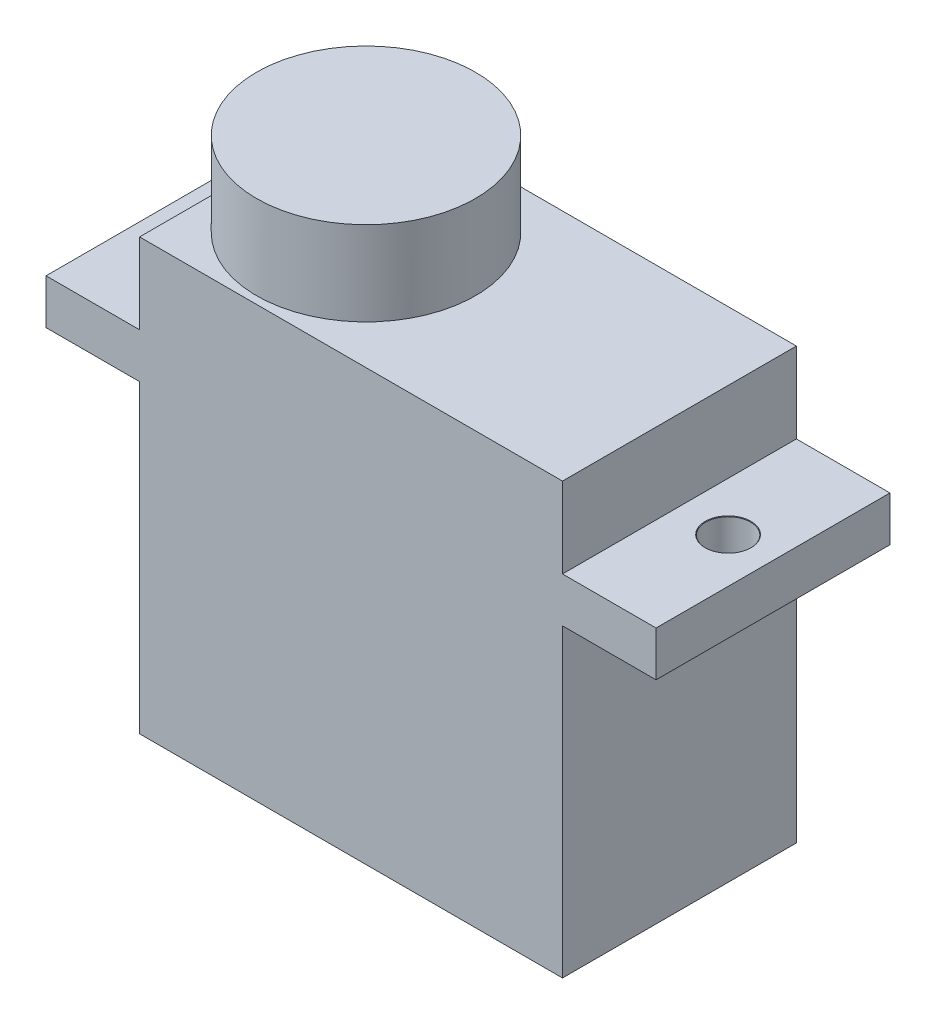
ISO-10303-21;
HEADER;
FILE_DESCRIPTION(('STEP AP214'),'2;1');
FILE_NAME('part.step','',(''),(''),'','','');
FILE_SCHEMA(('AUTOMOTIVE_DESIGN { 1 0 10303 214 1 1 1 1 }'));
ENDSEC;
DATA;
#1=APPLICATION_CONTEXT('core data for automotive mechanical design processes');
#2=APPLICATION_PROTOCOL_DEFINITION('international standard','automotive_design',2000,#1);
#3=PRODUCT_CONTEXT('',#1,'mechanical');
#4=PRODUCT('Part','Part','',(#3));
#5=PRODUCT_RELATED_PRODUCT_CATEGORY('part','',(#4));
#6=PRODUCT_DEFINITION_FORMATION('','',#4);
#7=PRODUCT_DEFINITION_CONTEXT('part definition',#1,'design');
#8=PRODUCT_DEFINITION('design','',#6,#7);
#9=PRODUCT_DEFINITION_SHAPE('','',#8);
#10=(LENGTH_UNIT() NAMED_UNIT(*) SI_UNIT(.MILLI.,.METRE.));
#11=(NAMED_UNIT(*) PLANE_ANGLE_UNIT() SI_UNIT($,.RADIAN.));
#12=(NAMED_UNIT(*) SI_UNIT($,.STERADIAN.) SOLID_ANGLE_UNIT());
#13=UNCERTAINTY_MEASURE_WITH_UNIT(LENGTH_MEASURE(1.E-05),#10,'distance_accuracy_value','');
#14=(GEOMETRIC_REPRESENTATION_CONTEXT(3) GLOBAL_UNCERTAINTY_ASSIGNED_CONTEXT((#13)) GLOBAL_UNIT_ASSIGNED_CONTEXT((#10,
#11,#12)) REPRESENTATION_CONTEXT('',''));
#15=CARTESIAN_POINT('',(0.,0.,0.));
#16=DIRECTION('',(0.,0.,1.));
#17=DIRECTION('',(1.,0.,0.));
#18=AXIS2_PLACEMENT_3D('',#15,#16,#17);
#19=CARTESIAN_POINT('',(0.,18.7,0.));
#20=DIRECTION('',(0.,-1.,0.));
#21=DIRECTION('',(0.,0.,-1.));
#22=AXIS2_PLACEMENT_3D('',#19,#20,#21);
#23=PLANE('',#22);
#24=DIRECTION('',(1.,0.,0.));
#25=VECTOR('',#24,1.);
#26=CARTESIAN_POINT('',(16.3,18.7,6.25));
#27=LINE('',#26,#25);
#28=CARTESIAN_POINT('',(11.3,18.7,6.25));
#29=VERTEX_POINT('',#28);
#30=CARTESIAN_POINT('',(16.3,18.7,6.25));
#31=VERTEX_POINT('',#30);
#32=EDGE_CURVE('E246',#29,#31,#27,.T.);
#33=ORIENTED_EDGE('',*,*,#32,.T.);
#34=DIRECTION('',(0.,0.,-1.));
#35=VECTOR('',#34,1.);
#36=CARTESIAN_POINT('',(16.3,18.7,-6.25));
#37=LINE('',#36,#35);
#38=CARTESIAN_POINT('',(16.3,18.7,-6.25));
#39=VERTEX_POINT('',#38);
#40=EDGE_CURVE('E265',#31,#39,#37,.T.);
#41=ORIENTED_EDGE('',*,*,#40,.T.);
#42=DIRECTION('',(-1.,0.,0.));
#43=VECTOR('',#42,1.);
#44=CARTESIAN_POINT('',(11.3,18.7,-6.25));
#45=LINE('',#44,#43);
#46=CARTESIAN_POINT('',(11.3,18.7,-6.25));
#47=VERTEX_POINT('',#46);
#48=EDGE_CURVE('E269',#39,#47,#45,.T.);
#49=ORIENTED_EDGE('',*,*,#48,.T.);
#50=DIRECTION('',(0.,0.,1.));
#51=VECTOR('',#50,1.);
#52=CARTESIAN_POINT('',(11.3,18.7,6.25));
#53=LINE('',#52,#51);
#54=EDGE_CURVE('E252',#47,#29,#53,.T.);
#55=ORIENTED_EDGE('',*,*,#54,.T.);
#56=EDGE_LOOP('',(#33,#41,#49,#55));
#57=FACE_BOUND('',#56,.T.);
#58=CARTESIAN_POINT('',(13.9,18.7,0.));
#59=DIRECTION('',(0.,1.,0.));
#60=DIRECTION('',(0.,0.,1.));
#61=AXIS2_PLACEMENT_3D('',#58,#59,#60);
#62=CIRCLE('',#61,1.225);
#63=CARTESIAN_POINT('',(13.9,18.7,1.225));
#64=VERTEX_POINT('',#63);
#65=EDGE_CURVE('E211',#64,#64,#62,.T.);
#66=ORIENTED_EDGE('',*,*,#65,.F.);
#67=EDGE_LOOP('',(#66));
#68=FACE_BOUND('',#67,.T.);
#69=ADVANCED_FACE('F39',(#57,#68),#23,.F.);
#70=CARTESIAN_POINT('',(-11.3,23.,-6.25));
#71=DIRECTION('',(1.,0.,0.));
#72=DIRECTION('',(0.,0.,-1.));
#73=AXIS2_PLACEMENT_3D('',#70,#71,#72);
#74=PLANE('',#73);
#75=DIRECTION('',(0.,0.,-1.));
#76=VECTOR('',#75,1.);
#77=CARTESIAN_POINT('',(-11.3,18.7,-6.25));
#78=LINE('',#77,#76);
#79=CARTESIAN_POINT('',(-11.3,18.7,6.25));
#80=VERTEX_POINT('',#79);
#81=CARTESIAN_POINT('',(-11.3,18.7,-6.25));
#82=VERTEX_POINT('',#81);
#83=EDGE_CURVE('E223',#80,#82,#78,.T.);
#84=ORIENTED_EDGE('',*,*,#83,.F.);
#85=DIRECTION('',(0.,-1.,0.));
#86=VECTOR('',#85,1.);
#87=CARTESIAN_POINT('',(-11.3,23.,6.25));
#88=LINE('',#87,#86);
#89=CARTESIAN_POINT('',(-11.3,23.,6.25));
#90=VERTEX_POINT('',#89);
#91=EDGE_CURVE('E11',#90,#80,#88,.T.);
#92=ORIENTED_EDGE('',*,*,#91,.F.);
#93=DIRECTION('',(0.,0.,1.));
#94=VECTOR('',#93,1.);
#95=CARTESIAN_POINT('',(-11.3,23.,-6.25));
#96=LINE('',#95,#94);
#97=CARTESIAN_POINT('',(-11.3,23.,0.));
#98=VERTEX_POINT('',#97);
#99=EDGE_CURVE('E150',#98,#90,#96,.T.);
#100=ORIENTED_EDGE('',*,*,#99,.F.);
#101=CARTESIAN_POINT('',(-11.3,23.,-6.25));
#102=VERTEX_POINT('',#101);
#103=EDGE_CURVE('E138',#102,#98,#96,.T.);
#104=ORIENTED_EDGE('',*,*,#103,.F.);
#105=DIRECTION('',(0.,-1.,0.));
#106=VECTOR('',#105,1.);
#107=CARTESIAN_POINT('',(-11.3,23.,-6.25));
#108=LINE('',#107,#106);
#109=EDGE_CURVE('E186',#102,#82,#108,.T.);
#110=ORIENTED_EDGE('',*,*,#109,.T.);
#111=EDGE_LOOP('',(#84,#92,#100,#104,#110));
#112=FACE_BOUND('',#111,.T.);
#113=ADVANCED_FACE('F154',(#112),#74,.F.);
#114=CARTESIAN_POINT('',(11.3,23.,-6.25));
#115=DIRECTION('',(-1.,0.,0.));
#116=DIRECTION('',(0.,0.,1.));
#117=AXIS2_PLACEMENT_3D('',#114,#115,#116);
#118=PLANE('',#117);
#119=ORIENTED_EDGE('',*,*,#54,.F.);
#120=DIRECTION('',(0.,-1.,0.));
#121=VECTOR('',#120,1.);
#122=CARTESIAN_POINT('',(11.3,23.,-6.25));
#123=LINE('',#122,#121);
#124=CARTESIAN_POINT('',(11.3,23.,-6.25));
#125=VERTEX_POINT('',#124);
#126=EDGE_CURVE('E190',#125,#47,#123,.T.);
#127=ORIENTED_EDGE('',*,*,#126,.F.);
#128=DIRECTION('',(0.,0.,-1.));
#129=VECTOR('',#128,1.);
#130=CARTESIAN_POINT('',(11.3,23.,-6.25));
#131=LINE('',#130,#129);
#132=CARTESIAN_POINT('',(11.3,23.,6.25));
#133=VERTEX_POINT('',#132);
#134=EDGE_CURVE('E168',#133,#125,#131,.T.);
#135=ORIENTED_EDGE('',*,*,#134,.F.);
#136=DIRECTION('',(0.,-1.,0.));
#137=VECTOR('',#136,1.);
#138=CARTESIAN_POINT('',(11.3,23.,6.25));
#139=LINE('',#138,#137);
#140=EDGE_CURVE('E195',#133,#29,#139,.T.);
#141=ORIENTED_EDGE('',*,*,#140,.T.);
#142=EDGE_LOOP('',(#119,#127,#135,#141));
#143=FACE_BOUND('',#142,.T.);
#144=ADVANCED_FACE('F290',(#143),#118,.F.);
#145=CARTESIAN_POINT('',(-11.3,16.3,6.25));
#146=VERTEX_POINT('',#145);
#147=CARTESIAN_POINT('',(-11.3,0.,6.25));
#148=VERTEX_POINT('',#147);
#149=EDGE_CURVE('E49',#146,#148,#88,.T.);
#150=ORIENTED_EDGE('',*,*,#149,.F.);
#151=DIRECTION('',(0.,0.,-1.));
#152=VECTOR('',#151,1.);
#153=CARTESIAN_POINT('',(-11.3,16.3,-6.25));
#154=LINE('',#153,#152);
#155=CARTESIAN_POINT('',(-11.3,16.3,-6.25));
#156=VERTEX_POINT('',#155);
#157=EDGE_CURVE('E230',#146,#156,#154,.T.);
#158=ORIENTED_EDGE('',*,*,#157,.T.);
#159=CARTESIAN_POINT('',(-11.3,0.,-6.25));
#160=VERTEX_POINT('',#159);
#161=EDGE_CURVE('E173',#156,#160,#108,.T.);
#162=ORIENTED_EDGE('',*,*,#161,.T.);
#163=DIRECTION('',(0.,0.,1.));
#164=VECTOR('',#163,1.);
#165=CARTESIAN_POINT('',(-11.3,0.,-6.25));
#166=LINE('',#165,#164);
#167=EDGE_CURVE('E174',#160,#148,#166,.T.);
#168=ORIENTED_EDGE('',*,*,#167,.T.);
#169=EDGE_LOOP('',(#150,#158,#162,#168));
#170=FACE_BOUND('',#169,.T.);
#171=ADVANCED_FACE('F41',(#170),#74,.F.);
#172=CARTESIAN_POINT('',(11.3,23.,6.25));
#173=DIRECTION('',(0.,0.,-1.));
#174=DIRECTION('',(-1.,0.,0.));
#175=AXIS2_PLACEMENT_3D('',#172,#173,#174);
#176=PLANE('',#175);
#177=DIRECTION('',(1.,0.,0.));
#178=VECTOR('',#177,1.);
#179=CARTESIAN_POINT('',(11.3,0.,6.25));
#180=LINE('',#179,#178);
#181=CARTESIAN_POINT('',(11.3,0.,6.25));
#182=VERTEX_POINT('',#181);
#183=EDGE_CURVE('E178',#148,#182,#180,.T.);
#184=ORIENTED_EDGE('',*,*,#183,.T.);
#185=CARTESIAN_POINT('',(11.3,16.3,6.25));
#186=VERTEX_POINT('',#185);
#187=EDGE_CURVE('E194',#186,#182,#139,.T.);
#188=ORIENTED_EDGE('',*,*,#187,.F.);
#189=DIRECTION('',(1.,0.,0.));
#190=VECTOR('',#189,1.);
#191=CARTESIAN_POINT('',(16.3,16.3,6.25));
#192=LINE('',#191,#190);
#193=CARTESIAN_POINT('',(16.3,16.3,6.25));
#194=VERTEX_POINT('',#193);
#195=EDGE_CURVE('E65',#186,#194,#192,.T.);
#196=ORIENTED_EDGE('',*,*,#195,.T.);
#197=DIRECTION('',(0.,1.,0.));
#198=VECTOR('',#197,1.);
#199=CARTESIAN_POINT('',(16.3,16.3,6.25));
#200=LINE('',#199,#198);
#201=EDGE_CURVE('E164',#194,#31,#200,.T.);
#202=ORIENTED_EDGE('',*,*,#201,.T.);
#203=ORIENTED_EDGE('',*,*,#32,.F.);
#204=ORIENTED_EDGE('',*,*,#140,.F.);
#205=DIRECTION('',(1.,0.,0.));
#206=VECTOR('',#205,1.);
#207=CARTESIAN_POINT('',(11.3,23.,6.25));
#208=LINE('',#207,#206);
#209=EDGE_CURVE('E149',#90,#133,#208,.T.);
#210=ORIENTED_EDGE('',*,*,#209,.F.);
#211=ORIENTED_EDGE('',*,*,#91,.T.);
#212=DIRECTION('',(1.,0.,0.));
#213=VECTOR('',#212,1.);
#214=CARTESIAN_POINT('',(-16.3,18.7,6.25));
#215=LINE('',#214,#213);
#216=CARTESIAN_POINT('',(-16.3,18.7,6.25));
#217=VERTEX_POINT('',#216);
#218=EDGE_CURVE('E237',#217,#80,#215,.T.);
#219=ORIENTED_EDGE('',*,*,#218,.F.);
#220=DIRECTION('',(0.,1.,0.));
#221=VECTOR('',#220,1.);
#222=CARTESIAN_POINT('',(-16.3,16.3,6.25));
#223=LINE('',#222,#221);
#224=CARTESIAN_POINT('',(-16.3,16.3,6.25));
#225=VERTEX_POINT('',#224);
#226=EDGE_CURVE('E243',#225,#217,#223,.T.);
#227=ORIENTED_EDGE('',*,*,#226,.F.);
#228=DIRECTION('',(1.,0.,0.));
#229=VECTOR('',#228,1.);
#230=CARTESIAN_POINT('',(-16.3,16.3,6.25));
#231=LINE('',#230,#229);
#232=EDGE_CURVE('E227',#225,#146,#231,.T.);
#233=ORIENTED_EDGE('',*,*,#232,.T.);
#234=ORIENTED_EDGE('',*,*,#149,.T.);
#235=EDGE_LOOP('',(#184,#188,#196,#202,#203,#204,#210,#211,#219,#227,#233,#234));
#236=FACE_BOUND('',#235,.T.);
#237=ADVANCED_FACE('F280',(#236),#176,.F.);
#238=CARTESIAN_POINT('',(11.3,16.3,-6.25));
#239=VERTEX_POINT('',#238);
#240=CARTESIAN_POINT('',(11.3,0.,-6.25));
#241=VERTEX_POINT('',#240);
#242=EDGE_CURVE('E189',#239,#241,#123,.T.);
#243=ORIENTED_EDGE('',*,*,#242,.F.);
#244=DIRECTION('',(0.,0.,1.));
#245=VECTOR('',#244,1.);
#246=CARTESIAN_POINT('',(11.3,16.3,6.25));
#247=LINE('',#246,#245);
#248=EDGE_CURVE('E259',#239,#186,#247,.T.);
#249=ORIENTED_EDGE('',*,*,#248,.T.);
#250=ORIENTED_EDGE('',*,*,#187,.T.);
#251=DIRECTION('',(0.,0.,-1.));
#252=VECTOR('',#251,1.);
#253=CARTESIAN_POINT('',(11.3,0.,-6.25));
#254=LINE('',#253,#252);
#255=EDGE_CURVE('E160',#182,#241,#254,.T.);
#256=ORIENTED_EDGE('',*,*,#255,.T.);
#257=EDGE_LOOP('',(#243,#249,#250,#256));
#258=FACE_BOUND('',#257,.T.);
#259=ADVANCED_FACE('F319',(#258),#118,.F.);
#260=CARTESIAN_POINT('',(11.3,23.,-6.25));
#261=DIRECTION('',(0.,0.,1.));
#262=DIRECTION('',(1.,0.,0.));
#263=AXIS2_PLACEMENT_3D('',#260,#261,#262);
#264=PLANE('',#263);
#265=DIRECTION('',(-1.,0.,0.));
#266=VECTOR('',#265,1.);
#267=CARTESIAN_POINT('',(11.3,0.,-6.25));
#268=LINE('',#267,#266);
#269=EDGE_CURVE('E157',#241,#160,#268,.T.);
#270=ORIENTED_EDGE('',*,*,#269,.T.);
#271=ORIENTED_EDGE('',*,*,#161,.F.);
#272=DIRECTION('',(-1.,0.,0.));
#273=VECTOR('',#272,1.);
#274=CARTESIAN_POINT('',(-11.3,16.3,-6.25));
#275=LINE('',#274,#273);
#276=CARTESIAN_POINT('',(-16.3,16.3,-6.25));
#277=VERTEX_POINT('',#276);
#278=EDGE_CURVE('E57',#156,#277,#275,.T.);
#279=ORIENTED_EDGE('',*,*,#278,.T.);
#280=DIRECTION('',(0.,1.,0.));
#281=VECTOR('',#280,1.);
#282=CARTESIAN_POINT('',(-16.3,16.3,-6.25));
#283=LINE('',#282,#281);
#284=CARTESIAN_POINT('',(-16.3,18.7,-6.25));
#285=VERTEX_POINT('',#284);
#286=EDGE_CURVE('E232',#277,#285,#283,.T.);
#287=ORIENTED_EDGE('',*,*,#286,.T.);
#288=DIRECTION('',(-1.,0.,0.));
#289=VECTOR('',#288,1.);
#290=CARTESIAN_POINT('',(-11.3,18.7,-6.25));
#291=LINE('',#290,#289);
#292=EDGE_CURVE('E201',#82,#285,#291,.T.);
#293=ORIENTED_EDGE('',*,*,#292,.F.);
#294=ORIENTED_EDGE('',*,*,#109,.F.);
#295=DIRECTION('',(-1.,0.,0.));
#296=VECTOR('',#295,1.);
#297=CARTESIAN_POINT('',(11.3,23.,-6.25));
#298=LINE('',#297,#296);
#299=EDGE_CURVE('E144',#125,#102,#298,.T.);
#300=ORIENTED_EDGE('',*,*,#299,.F.);
#301=ORIENTED_EDGE('',*,*,#126,.T.);
#302=ORIENTED_EDGE('',*,*,#48,.F.);
#303=DIRECTION('',(0.,1.,0.));
#304=VECTOR('',#303,1.);
#305=CARTESIAN_POINT('',(16.3,16.3,-6.25));
#306=LINE('',#305,#304);
#307=CARTESIAN_POINT('',(16.3,16.3,-6.25));
#308=VERTEX_POINT('',#307);
#309=EDGE_CURVE('E179',#308,#39,#306,.T.);
#310=ORIENTED_EDGE('',*,*,#309,.F.);
#311=DIRECTION('',(-1.,0.,0.));
#312=VECTOR('',#311,1.);
#313=CARTESIAN_POINT('',(11.3,16.3,-6.25));
#314=LINE('',#313,#312);
#315=EDGE_CURVE('E256',#308,#239,#314,.T.);
#316=ORIENTED_EDGE('',*,*,#315,.T.);
#317=ORIENTED_EDGE('',*,*,#242,.T.);
#318=EDGE_LOOP('',(#270,#271,#279,#287,#293,#294,#300,#301,#302,#310,#316,#317));
#319=FACE_BOUND('',#318,.T.);
#320=ADVANCED_FACE('F293',(#319),#264,.F.);
#321=CARTESIAN_POINT('',(0.,23.,0.));
#322=DIRECTION('',(0.,-1.,0.));
#323=DIRECTION('',(0.,0.,-1.));
#324=AXIS2_PLACEMENT_3D('',#321,#322,#323);
#325=PLANE('',#324);
#326=ORIENTED_EDGE('',*,*,#103,.T.);
#327=CARTESIAN_POINT('',(-5.45000000000001,23.,0.));
#328=DIRECTION('',(0.,1.,0.));
#329=DIRECTION('',(0.,0.,1.));
#330=AXIS2_PLACEMENT_3D('',#327,#328,#329);
#331=CIRCLE('',#330,5.85);
#332=EDGE_CURVE('E142',#98,#98,#331,.T.);
#333=ORIENTED_EDGE('',*,*,#332,.F.);
#334=ORIENTED_EDGE('',*,*,#99,.T.);
#335=ORIENTED_EDGE('',*,*,#209,.T.);
#336=ORIENTED_EDGE('',*,*,#134,.T.);
#337=ORIENTED_EDGE('',*,*,#299,.T.);
#338=EDGE_LOOP('',(#326,#333,#334,#335,#336,#337));
#339=FACE_BOUND('',#338,.T.);
#340=ADVANCED_FACE('F140',(#339),#325,.F.);
#341=CARTESIAN_POINT('',(0.,0.,0.));
#342=DIRECTION('',(0.,-1.,0.));
#343=DIRECTION('',(0.,0.,-1.));
#344=AXIS2_PLACEMENT_3D('',#341,#342,#343);
#345=PLANE('',#344);
#346=ORIENTED_EDGE('',*,*,#167,.F.);
#347=ORIENTED_EDGE('',*,*,#269,.F.);
#348=ORIENTED_EDGE('',*,*,#255,.F.);
#349=ORIENTED_EDGE('',*,*,#183,.F.);
#350=EDGE_LOOP('',(#346,#347,#348,#349));
#351=FACE_BOUND('',#350,.T.);
#352=ADVANCED_FACE('F313',(#351),#345,.T.);
#353=CARTESIAN_POINT('',(16.3,16.3,-6.25));
#354=DIRECTION('',(1.,0.,0.));
#355=DIRECTION('',(0.,0.,-1.));
#356=AXIS2_PLACEMENT_3D('',#353,#354,#355);
#357=PLANE('',#356);
#358=ORIENTED_EDGE('',*,*,#40,.F.);
#359=ORIENTED_EDGE('',*,*,#201,.F.);
#360=DIRECTION('',(0.,0.,-1.));
#361=VECTOR('',#360,1.);
#362=CARTESIAN_POINT('',(16.3,16.3,-6.25));
#363=LINE('',#362,#361);
#364=EDGE_CURVE('E251',#194,#308,#363,.T.);
#365=ORIENTED_EDGE('',*,*,#364,.T.);
#366=ORIENTED_EDGE('',*,*,#309,.T.);
#367=EDGE_LOOP('',(#358,#359,#365,#366));
#368=FACE_BOUND('',#367,.T.);
#369=ADVANCED_FACE('F283',(#368),#357,.T.);
#370=CARTESIAN_POINT('',(0.,16.3,0.));
#371=DIRECTION('',(0.,-1.,0.));
#372=DIRECTION('',(0.,0.,-1.));
#373=AXIS2_PLACEMENT_3D('',#370,#371,#372);
#374=PLANE('',#373);
#375=CARTESIAN_POINT('',(13.9,16.3,0.));
#376=DIRECTION('',(0.,-1.,0.));
#377=DIRECTION('',(0.,0.,-1.));
#378=AXIS2_PLACEMENT_3D('',#375,#376,#377);
#379=CIRCLE('',#378,1.19999999999999);
#380=CARTESIAN_POINT('',(13.9,16.3,-1.19999999999999));
#381=VERTEX_POINT('',#380);
#382=EDGE_CURVE('E198',#381,#381,#379,.T.);
#383=ORIENTED_EDGE('',*,*,#382,.F.);
#384=EDGE_LOOP('',(#383));
#385=FACE_BOUND('',#384,.T.);
#386=ORIENTED_EDGE('',*,*,#195,.F.);
#387=ORIENTED_EDGE('',*,*,#248,.F.);
#388=ORIENTED_EDGE('',*,*,#315,.F.);
#389=ORIENTED_EDGE('',*,*,#364,.F.);
#390=EDGE_LOOP('',(#386,#387,#388,#389));
#391=FACE_BOUND('',#390,.T.);
#392=ADVANCED_FACE('F328',(#385,#391),#374,.T.);
#393=CARTESIAN_POINT('',(-16.3,16.3,-6.25));
#394=DIRECTION('',(-1.,0.,0.));
#395=DIRECTION('',(0.,0.,1.));
#396=AXIS2_PLACEMENT_3D('',#393,#394,#395);
#397=PLANE('',#396);
#398=DIRECTION('',(0.,0.,1.));
#399=VECTOR('',#398,1.);
#400=CARTESIAN_POINT('',(-16.3,18.7,-6.25));
#401=LINE('',#400,#399);
#402=EDGE_CURVE('E208',#285,#217,#401,.T.);
#403=ORIENTED_EDGE('',*,*,#402,.F.);
#404=ORIENTED_EDGE('',*,*,#286,.F.);
#405=DIRECTION('',(0.,0.,1.));
#406=VECTOR('',#405,1.);
#407=CARTESIAN_POINT('',(-16.3,16.3,-6.25));
#408=LINE('',#407,#406);
#409=EDGE_CURVE('E222',#277,#225,#408,.T.);
#410=ORIENTED_EDGE('',*,*,#409,.T.);
#411=ORIENTED_EDGE('',*,*,#226,.T.);
#412=EDGE_LOOP('',(#403,#404,#410,#411));
#413=FACE_BOUND('',#412,.T.);
#414=ADVANCED_FACE('F301',(#413),#397,.T.);
#415=CARTESIAN_POINT('',(0.,16.3,0.));
#416=DIRECTION('',(0.,1.,0.));
#417=DIRECTION('',(0.,0.,1.));
#418=AXIS2_PLACEMENT_3D('',#415,#416,#417);
#419=PLANE('',#418);
#420=CARTESIAN_POINT('',(-13.9,16.3,0.));
#421=DIRECTION('',(0.,1.,0.));
#422=DIRECTION('',(0.,0.,1.));
#423=AXIS2_PLACEMENT_3D('',#420,#421,#422);
#424=CIRCLE('',#423,1.19999999999999);
#425=CARTESIAN_POINT('',(-13.9,16.3,1.19999999999999));
#426=VERTEX_POINT('',#425);
#427=EDGE_CURVE('E43',#426,#426,#424,.T.);
#428=ORIENTED_EDGE('',*,*,#427,.T.);
#429=EDGE_LOOP('',(#428));
#430=FACE_BOUND('',#429,.T.);
#431=ORIENTED_EDGE('',*,*,#278,.F.);
#432=ORIENTED_EDGE('',*,*,#157,.F.);
#433=ORIENTED_EDGE('',*,*,#232,.F.);
#434=ORIENTED_EDGE('',*,*,#409,.F.);
#435=EDGE_LOOP('',(#431,#432,#433,#434));
#436=FACE_BOUND('',#435,.T.);
#437=ADVANCED_FACE('F299',(#430,#436),#419,.F.);
#438=CARTESIAN_POINT('',(0.,18.7,0.));
#439=DIRECTION('',(0.,1.,0.));
#440=DIRECTION('',(0.,0.,1.));
#441=AXIS2_PLACEMENT_3D('',#438,#439,#440);
#442=PLANE('',#441);
#443=CARTESIAN_POINT('',(-13.9,18.7,0.));
#444=DIRECTION('',(0.,1.,0.));
#445=DIRECTION('',(0.,0.,1.));
#446=AXIS2_PLACEMENT_3D('',#443,#444,#445);
#447=CIRCLE('',#446,1.225);
#448=CARTESIAN_POINT('',(-13.9,18.7,1.225));
#449=VERTEX_POINT('',#448);
#450=EDGE_CURVE('E385',#449,#449,#447,.T.);
#451=ORIENTED_EDGE('',*,*,#450,.F.);
#452=EDGE_LOOP('',(#451));
#453=FACE_BOUND('',#452,.T.);
#454=ORIENTED_EDGE('',*,*,#292,.T.);
#455=ORIENTED_EDGE('',*,*,#402,.T.);
#456=ORIENTED_EDGE('',*,*,#218,.T.);
#457=ORIENTED_EDGE('',*,*,#83,.T.);
#458=EDGE_LOOP('',(#454,#455,#456,#457));
#459=FACE_BOUND('',#458,.T.);
#460=ADVANCED_FACE('F295',(#453,#459),#442,.T.);
#461=CARTESIAN_POINT('',(13.9,18.7,0.));
#462=DIRECTION('',(0.,1.,0.));
#463=DIRECTION('',(0.,0.,1.));
#464=AXIS2_PLACEMENT_3D('',#461,#462,#463);
#465=CYLINDRICAL_SURFACE('',#464,1.19999999999999);
#466=ORIENTED_EDGE('',*,*,#382,.T.);
#467=EDGE_LOOP('',(#466));
#468=FACE_BOUND('',#467,.T.);
#469=CARTESIAN_POINT('',(13.9,18.675,0.));
#470=DIRECTION('',(0.,1.,0.));
#471=DIRECTION('',(0.,0.,1.));
#472=AXIS2_PLACEMENT_3D('',#469,#470,#471);
#473=CIRCLE('',#472,1.2);
#474=CARTESIAN_POINT('',(13.9,18.675,1.2));
#475=VERTEX_POINT('',#474);
#476=EDGE_CURVE('E202',#475,#475,#473,.T.);
#477=ORIENTED_EDGE('',*,*,#476,.T.);
#478=EDGE_LOOP('',(#477));
#479=FACE_BOUND('',#478,.T.);
#480=ADVANCED_FACE('F355',(#468,#479),#465,.F.);
#481=CARTESIAN_POINT('',(13.9,18.7,0.));
#482=DIRECTION('',(0.,1.,0.));
#483=DIRECTION('',(0.,0.,1.));
#484=AXIS2_PLACEMENT_3D('',#481,#482,#483);
#485=CONICAL_SURFACE('',#484,1.225,0.785398163397344);
#486=ORIENTED_EDGE('',*,*,#476,.F.);
#487=EDGE_LOOP('',(#486));
#488=FACE_BOUND('',#487,.T.);
#489=ORIENTED_EDGE('',*,*,#65,.T.);
#490=EDGE_LOOP('',(#489));
#491=FACE_BOUND('',#490,.T.);
#492=ADVANCED_FACE('F360',(#488,#491),#485,.F.);
#493=CARTESIAN_POINT('',(-13.9,18.7,0.));
#494=DIRECTION('',(0.,1.,0.));
#495=DIRECTION('',(0.,0.,1.));
#496=AXIS2_PLACEMENT_3D('',#493,#494,#495);
#497=CYLINDRICAL_SURFACE('',#496,1.19999999999999);
#498=CARTESIAN_POINT('',(-13.9,18.675,0.));
#499=DIRECTION('',(0.,1.,0.));
#500=DIRECTION('',(0.,0.,1.));
#501=AXIS2_PLACEMENT_3D('',#498,#499,#500);
#502=CIRCLE('',#501,1.2);
#503=CARTESIAN_POINT('',(-13.9,18.675,1.2));
#504=VERTEX_POINT('',#503);
#505=EDGE_CURVE('E390',#504,#504,#502,.T.);
#506=ORIENTED_EDGE('',*,*,#505,.T.);
#507=EDGE_LOOP('',(#506));
#508=FACE_BOUND('',#507,.T.);
#509=ORIENTED_EDGE('',*,*,#427,.F.);
#510=EDGE_LOOP('',(#509));
#511=FACE_BOUND('',#510,.T.);
#512=ADVANCED_FACE('F363',(#508,#511),#497,.F.);
#513=CARTESIAN_POINT('',(-13.9,18.7,0.));
#514=DIRECTION('',(0.,1.,0.));
#515=DIRECTION('',(0.,0.,1.));
#516=AXIS2_PLACEMENT_3D('',#513,#514,#515);
#517=CONICAL_SURFACE('',#516,1.225,0.785398163397344);
#518=ORIENTED_EDGE('',*,*,#505,.F.);
#519=EDGE_LOOP('',(#518));
#520=FACE_BOUND('',#519,.T.);
#521=ORIENTED_EDGE('',*,*,#450,.T.);
#522=EDGE_LOOP('',(#521));
#523=FACE_BOUND('',#522,.T.);
#524=ADVANCED_FACE('F367',(#520,#523),#517,.F.);
#525=CARTESIAN_POINT('',(-5.45000000000001,27.5,0.));
#526=DIRECTION('',(0.,-1.,0.));
#527=DIRECTION('',(0.,0.,-1.));
#528=AXIS2_PLACEMENT_3D('',#525,#526,#527);
#529=CYLINDRICAL_SURFACE('',#528,5.85);
#530=CARTESIAN_POINT('',(-5.45000000000001,27.5,0.));
#531=DIRECTION('',(0.,1.,0.));
#532=DIRECTION('',(0.,0.,1.));
#533=AXIS2_PLACEMENT_3D('',#530,#531,#532);
#534=CIRCLE('',#533,5.85);
#535=CARTESIAN_POINT('',(-5.45000000000001,27.5,5.85));
#536=VERTEX_POINT('',#535);
#537=EDGE_CURVE('E383',#536,#536,#534,.T.);
#538=ORIENTED_EDGE('',*,*,#537,.F.);
#539=EDGE_LOOP('',(#538));
#540=FACE_BOUND('',#539,.T.);
#541=ORIENTED_EDGE('',*,*,#332,.T.);
#542=EDGE_LOOP('',(#541));
#543=FACE_BOUND('',#542,.T.);
#544=ADVANCED_FACE('F371',(#540,#543),#529,.T.);
#545=CARTESIAN_POINT('',(-5.45000000000001,27.5,0.));
#546=DIRECTION('',(0.,1.,0.));
#547=DIRECTION('',(0.,0.,1.));
#548=AXIS2_PLACEMENT_3D('',#545,#546,#547);
#549=PLANE('',#548);
#550=ORIENTED_EDGE('',*,*,#537,.T.);
#551=EDGE_LOOP('',(#550));
#552=FACE_BOUND('',#551,.T.);
#553=ADVANCED_FACE('F375',(#552),#549,.T.);
#554=CLOSED_SHELL('',(#69,#113,#144,#171,#237,#259,#320,#340,#352,#369,#392,#414,#437,#460,#480,
#492,#512,#524,#544,#553));
#555=MANIFOLD_SOLID_BREP('B2',#554);
#556=ADVANCED_BREP_SHAPE_REPRESENTATION('',(#18,#555),#14);
#557=SHAPE_DEFINITION_REPRESENTATION(#9,#556);
ENDSEC;
END-ISO-10303-21;
